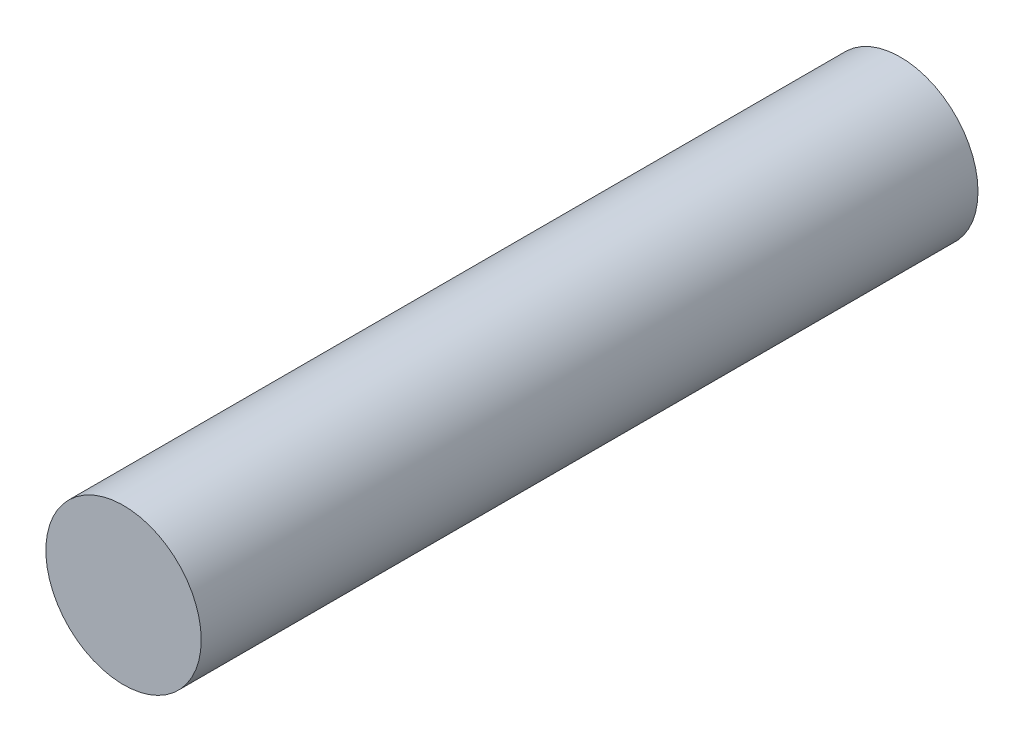
ISO-10303-21;
HEADER;
FILE_DESCRIPTION(('STEP AP214'),'2;1');
FILE_NAME('part.step','',(''),(''),'','','');
FILE_SCHEMA(('AUTOMOTIVE_DESIGN { 1 0 10303 214 1 1 1 1 }'));
ENDSEC;
DATA;
#1=APPLICATION_CONTEXT('core data for automotive mechanical design processes');
#2=APPLICATION_PROTOCOL_DEFINITION('international standard','automotive_design',2000,#1);
#3=PRODUCT_CONTEXT('',#1,'mechanical');
#4=PRODUCT('Part','Part','',(#3));
#5=PRODUCT_RELATED_PRODUCT_CATEGORY('part','',(#4));
#6=PRODUCT_DEFINITION_FORMATION('','',#4);
#7=PRODUCT_DEFINITION_CONTEXT('part definition',#1,'design');
#8=PRODUCT_DEFINITION('design','',#6,#7);
#9=PRODUCT_DEFINITION_SHAPE('','',#8);
#10=(LENGTH_UNIT() NAMED_UNIT(*) SI_UNIT(.MILLI.,.METRE.));
#11=(NAMED_UNIT(*) PLANE_ANGLE_UNIT() SI_UNIT($,.RADIAN.));
#12=(NAMED_UNIT(*) SI_UNIT($,.STERADIAN.) SOLID_ANGLE_UNIT());
#13=UNCERTAINTY_MEASURE_WITH_UNIT(LENGTH_MEASURE(1.E-05),#10,'distance_accuracy_value','');
#14=(GEOMETRIC_REPRESENTATION_CONTEXT(3) GLOBAL_UNCERTAINTY_ASSIGNED_CONTEXT((#13)) GLOBAL_UNIT_ASSIGNED_CONTEXT((#10,
#11,#12)) REPRESENTATION_CONTEXT('',''));
#15=CARTESIAN_POINT('',(0.,0.,0.));
#16=DIRECTION('',(0.,0.,1.));
#17=DIRECTION('',(1.,0.,0.));
#18=AXIS2_PLACEMENT_3D('',#15,#16,#17);
#19=CARTESIAN_POINT('',(0.,0.,50.));
#20=DIRECTION('',(0.,0.,-1.));
#21=DIRECTION('',(-1.,0.,0.));
#22=AXIS2_PLACEMENT_3D('',#19,#20,#21);
#23=CYLINDRICAL_SURFACE('',#22,5.);
#24=CARTESIAN_POINT('',(0.,0.,50.));
#25=DIRECTION('',(0.,0.,1.));
#26=DIRECTION('',(1.,0.,0.));
#27=AXIS2_PLACEMENT_3D('',#24,#25,#26);
#28=CIRCLE('',#27,5.);
#29=CARTESIAN_POINT('',(5.,0.,50.));
#30=VERTEX_POINT('',#29);
#31=EDGE_CURVE('E10',#30,#30,#28,.T.);
#32=ORIENTED_EDGE('',*,*,#31,.F.);
#33=EDGE_LOOP('',(#32));
#34=FACE_BOUND('',#33,.T.);
#35=CARTESIAN_POINT('',(0.,0.,0.));
#36=DIRECTION('',(0.,0.,1.));
#37=DIRECTION('',(1.,0.,0.));
#38=AXIS2_PLACEMENT_3D('',#35,#36,#37);
#39=CIRCLE('',#38,5.);
#40=CARTESIAN_POINT('',(5.,0.,0.));
#41=VERTEX_POINT('',#40);
#42=EDGE_CURVE('E34',#41,#41,#39,.T.);
#43=ORIENTED_EDGE('',*,*,#42,.T.);
#44=EDGE_LOOP('',(#43));
#45=FACE_BOUND('',#44,.T.);
#46=ADVANCED_FACE('F31',(#34,#45),#23,.T.);
#47=CARTESIAN_POINT('',(0.,0.,50.));
#48=DIRECTION('',(0.,0.,1.));
#49=DIRECTION('',(1.,0.,0.));
#50=AXIS2_PLACEMENT_3D('',#47,#48,#49);
#51=PLANE('',#50);
#52=ORIENTED_EDGE('',*,*,#31,.T.);
#53=EDGE_LOOP('',(#52));
#54=FACE_BOUND('',#53,.T.);
#55=ADVANCED_FACE('F46',(#54),#51,.T.);
#56=CARTESIAN_POINT('',(0.,0.,0.));
#57=DIRECTION('',(0.,0.,1.));
#58=DIRECTION('',(1.,0.,0.));
#59=AXIS2_PLACEMENT_3D('',#56,#57,#58);
#60=PLANE('',#59);
#61=ORIENTED_EDGE('',*,*,#42,.F.);
#62=EDGE_LOOP('',(#61));
#63=FACE_BOUND('',#62,.T.);
#64=ADVANCED_FACE('F44',(#63),#60,.F.);
#65=CLOSED_SHELL('',(#46,#55,#64));
#66=MANIFOLD_SOLID_BREP('B2',#65);
#67=ADVANCED_BREP_SHAPE_REPRESENTATION('',(#18,#66),#14);
#68=SHAPE_DEFINITION_REPRESENTATION(#9,#67);
ENDSEC;
END-ISO-10303-21;
